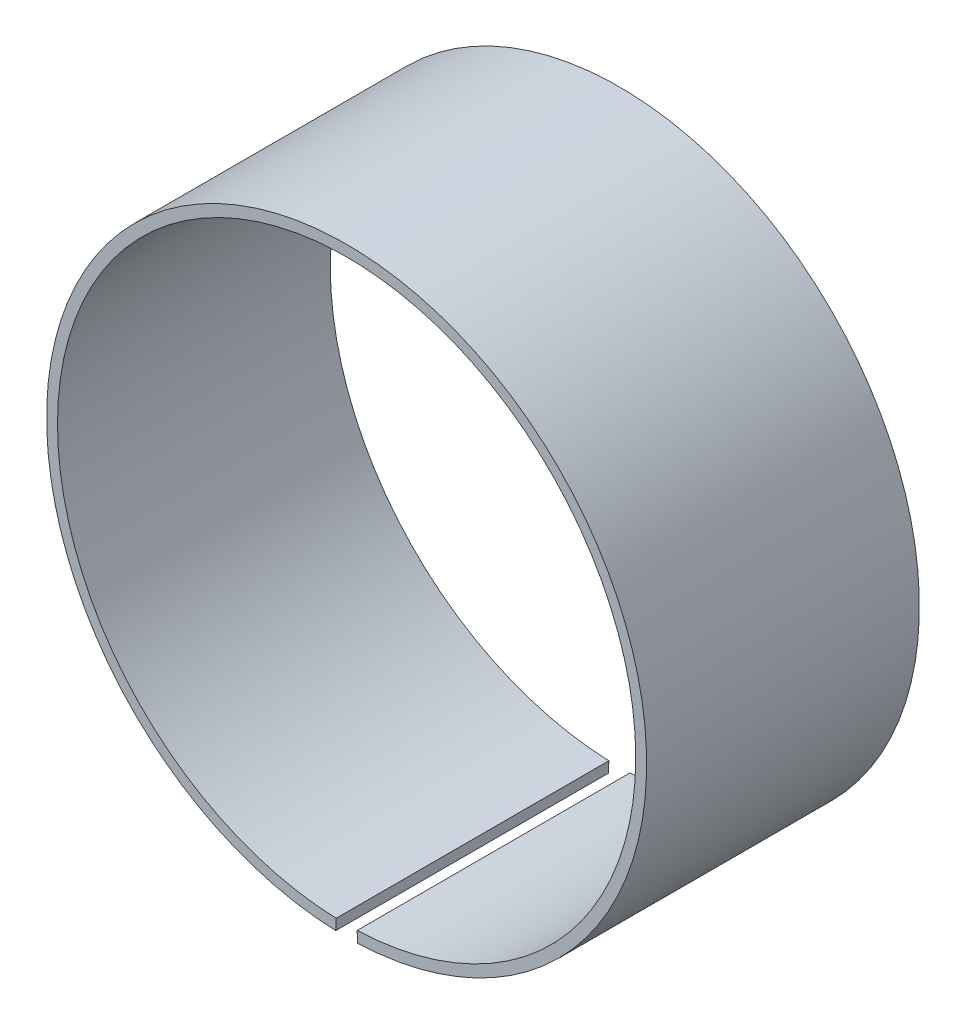
ISO-10303-21;
HEADER;
FILE_DESCRIPTION(('STEP AP214'),'2;1');
FILE_NAME('part.step','',(''),(''),'','','');
FILE_SCHEMA(('AUTOMOTIVE_DESIGN { 1 0 10303 214 1 1 1 1 }'));
ENDSEC;
DATA;
#1=APPLICATION_CONTEXT('core data for automotive mechanical design processes');
#2=APPLICATION_PROTOCOL_DEFINITION('international standard','automotive_design',2000,#1);
#3=PRODUCT_CONTEXT('',#1,'mechanical');
#4=PRODUCT('Part','Part','',(#3));
#5=PRODUCT_RELATED_PRODUCT_CATEGORY('part','',(#4));
#6=PRODUCT_DEFINITION_FORMATION('','',#4);
#7=PRODUCT_DEFINITION_CONTEXT('part definition',#1,'design');
#8=PRODUCT_DEFINITION('design','',#6,#7);
#9=PRODUCT_DEFINITION_SHAPE('','',#8);
#10=(LENGTH_UNIT() NAMED_UNIT(*) SI_UNIT(.MILLI.,.METRE.));
#11=(NAMED_UNIT(*) PLANE_ANGLE_UNIT() SI_UNIT($,.RADIAN.));
#12=(NAMED_UNIT(*) SI_UNIT($,.STERADIAN.) SOLID_ANGLE_UNIT());
#13=UNCERTAINTY_MEASURE_WITH_UNIT(LENGTH_MEASURE(1.E-05),#10,'distance_accuracy_value','');
#14=(GEOMETRIC_REPRESENTATION_CONTEXT(3) GLOBAL_UNCERTAINTY_ASSIGNED_CONTEXT((#13)) GLOBAL_UNIT_ASSIGNED_CONTEXT((#10,
#11,#12)) REPRESENTATION_CONTEXT('',''));
#15=CARTESIAN_POINT('',(0.,0.,0.));
#16=DIRECTION('',(0.,0.,1.));
#17=DIRECTION('',(1.,0.,0.));
#18=AXIS2_PLACEMENT_3D('',#15,#16,#17);
#19=CARTESIAN_POINT('',(0.,0.,2.5));
#20=DIRECTION('',(0.,0.,-1.));
#21=DIRECTION('',(-1.,0.,0.));
#22=AXIS2_PLACEMENT_3D('',#19,#20,#21);
#23=CYLINDRICAL_SURFACE('',#22,5.3);
#24=CARTESIAN_POINT('',(0.,0.,-2.5));
#25=DIRECTION('',(0.,0.,1.));
#26=DIRECTION('',(1.,0.,0.));
#27=AXIS2_PLACEMENT_3D('',#24,#25,#26);
#28=CIRCLE('',#27,5.3);
#29=CARTESIAN_POINT('',(-0.192727272727274,-5.29649470861126,-2.5));
#30=VERTEX_POINT('',#29);
#31=CARTESIAN_POINT('',(0.192727272727277,-5.29649470861126,-2.5));
#32=VERTEX_POINT('',#31);
#33=EDGE_CURVE('E100',#30,#32,#28,.F.);
#34=ORIENTED_EDGE('',*,*,#33,.T.);
#35=DIRECTION('',(0.,0.,-1.));
#36=VECTOR('',#35,1.);
#37=CARTESIAN_POINT('',(0.192727272727277,-5.29649470861126,2.5));
#38=LINE('',#37,#36);
#39=CARTESIAN_POINT('',(0.192727272727277,-5.29649470861126,2.5));
#40=VERTEX_POINT('',#39);
#41=EDGE_CURVE('E11',#40,#32,#38,.T.);
#42=ORIENTED_EDGE('',*,*,#41,.F.);
#43=CARTESIAN_POINT('',(0.,0.,2.5));
#44=DIRECTION('',(0.,0.,1.));
#45=DIRECTION('',(1.,0.,0.));
#46=AXIS2_PLACEMENT_3D('',#43,#44,#45);
#47=CIRCLE('',#46,5.3);
#48=CARTESIAN_POINT('',(-0.192727272727274,-5.29649470861126,2.5));
#49=VERTEX_POINT('',#48);
#50=EDGE_CURVE('E77',#49,#40,#47,.F.);
#51=ORIENTED_EDGE('',*,*,#50,.F.);
#52=DIRECTION('',(0.,0.,-1.));
#53=VECTOR('',#52,1.);
#54=CARTESIAN_POINT('',(-0.192727272727274,-5.29649470861126,2.5));
#55=LINE('',#54,#53);
#56=EDGE_CURVE('E53',#49,#30,#55,.T.);
#57=ORIENTED_EDGE('',*,*,#56,.T.);
#58=EDGE_LOOP('',(#34,#42,#51,#57));
#59=FACE_BOUND('',#58,.T.);
#60=ADVANCED_FACE('F37',(#59),#23,.F.);
#61=CARTESIAN_POINT('',(0.200000000000006,-5.49636243346452,2.5));
#62=DIRECTION('',(-0.999338624266276,-0.0363636363636472,0.));
#63=DIRECTION('',(0.0363636363636472,-0.999338624266276,0.));
#64=AXIS2_PLACEMENT_3D('',#61,#62,#63);
#65=PLANE('',#64);
#66=DIRECTION('',(-0.0363636363636472,0.999338624266276,0.));
#67=VECTOR('',#66,1.);
#68=CARTESIAN_POINT('',(0.200000000000006,-5.49636243346452,-2.5));
#69=LINE('',#68,#67);
#70=CARTESIAN_POINT('',(0.200000000000006,-5.49636243346452,-2.5));
#71=VERTEX_POINT('',#70);
#72=EDGE_CURVE('E86',#71,#32,#69,.T.);
#73=ORIENTED_EDGE('',*,*,#72,.F.);
#74=DIRECTION('',(0.,0.,-1.));
#75=VECTOR('',#74,1.);
#76=CARTESIAN_POINT('',(0.200000000000006,-5.49636243346452,2.5));
#77=LINE('',#76,#75);
#78=CARTESIAN_POINT('',(0.200000000000006,-5.49636243346452,2.5));
#79=VERTEX_POINT('',#78);
#80=EDGE_CURVE('E45',#79,#71,#77,.T.);
#81=ORIENTED_EDGE('',*,*,#80,.F.);
#82=DIRECTION('',(-0.0363636363636472,0.999338624266276,0.));
#83=VECTOR('',#82,1.);
#84=CARTESIAN_POINT('',(0.200000000000006,-5.49636243346452,2.5));
#85=LINE('',#84,#83);
#86=EDGE_CURVE('E84',#79,#40,#85,.T.);
#87=ORIENTED_EDGE('',*,*,#86,.T.);
#88=ORIENTED_EDGE('',*,*,#41,.T.);
#89=EDGE_LOOP('',(#73,#81,#87,#88));
#90=FACE_BOUND('',#89,.T.);
#91=ADVANCED_FACE('F83',(#90),#65,.T.);
#92=CARTESIAN_POINT('',(0.,0.,2.5));
#93=DIRECTION('',(0.,0.,-1.));
#94=DIRECTION('',(-1.,0.,0.));
#95=AXIS2_PLACEMENT_3D('',#92,#93,#94);
#96=CYLINDRICAL_SURFACE('',#95,5.5);
#97=CARTESIAN_POINT('',(0.,0.,-2.5));
#98=DIRECTION('',(0.,0.,-1.));
#99=DIRECTION('',(-1.,0.,0.));
#100=AXIS2_PLACEMENT_3D('',#97,#98,#99);
#101=CIRCLE('',#100,5.5);
#102=CARTESIAN_POINT('',(-0.199999999999999,-5.49636243346452,-2.5));
#103=VERTEX_POINT('',#102);
#104=EDGE_CURVE('E103',#103,#71,#101,.T.);
#105=ORIENTED_EDGE('',*,*,#104,.F.);
#106=DIRECTION('',(0.,0.,-1.));
#107=VECTOR('',#106,1.);
#108=CARTESIAN_POINT('',(-0.199999999999999,-5.49636243346452,2.5));
#109=LINE('',#108,#107);
#110=CARTESIAN_POINT('',(-0.199999999999999,-5.49636243346452,2.5));
#111=VERTEX_POINT('',#110);
#112=EDGE_CURVE('E66',#111,#103,#109,.T.);
#113=ORIENTED_EDGE('',*,*,#112,.F.);
#114=CARTESIAN_POINT('',(0.,0.,2.5));
#115=DIRECTION('',(0.,0.,-1.));
#116=DIRECTION('',(-1.,0.,0.));
#117=AXIS2_PLACEMENT_3D('',#114,#115,#116);
#118=CIRCLE('',#117,5.5);
#119=EDGE_CURVE('E92',#111,#79,#118,.T.);
#120=ORIENTED_EDGE('',*,*,#119,.T.);
#121=ORIENTED_EDGE('',*,*,#80,.T.);
#122=EDGE_LOOP('',(#105,#113,#120,#121));
#123=FACE_BOUND('',#122,.T.);
#124=ADVANCED_FACE('F94',(#123),#96,.T.);
#125=CARTESIAN_POINT('',(-0.192727272727274,-5.29649470861126,2.5));
#126=DIRECTION('',(0.999338624266277,-0.0363636363636268,0.));
#127=DIRECTION('',(0.0363636363636268,0.999338624266277,0.));
#128=AXIS2_PLACEMENT_3D('',#125,#126,#127);
#129=PLANE('',#128);
#130=DIRECTION('',(-0.0363636363636268,-0.999338624266276,0.));
#131=VECTOR('',#130,1.);
#132=CARTESIAN_POINT('',(-0.192727272727274,-5.29649470861126,-2.5));
#133=LINE('',#132,#131);
#134=EDGE_CURVE('E105',#30,#103,#133,.T.);
#135=ORIENTED_EDGE('',*,*,#134,.F.);
#136=ORIENTED_EDGE('',*,*,#56,.F.);
#137=DIRECTION('',(-0.0363636363636268,-0.999338624266276,0.));
#138=VECTOR('',#137,1.);
#139=CARTESIAN_POINT('',(-0.192727272727274,-5.29649470861126,2.5));
#140=LINE('',#139,#138);
#141=EDGE_CURVE('E95',#49,#111,#140,.T.);
#142=ORIENTED_EDGE('',*,*,#141,.T.);
#143=ORIENTED_EDGE('',*,*,#112,.T.);
#144=EDGE_LOOP('',(#135,#136,#142,#143));
#145=FACE_BOUND('',#144,.T.);
#146=ADVANCED_FACE('F111',(#145),#129,.T.);
#147=CARTESIAN_POINT('',(0.,0.,2.5));
#148=DIRECTION('',(0.,0.,1.));
#149=DIRECTION('',(1.,0.,0.));
#150=AXIS2_PLACEMENT_3D('',#147,#148,#149);
#151=PLANE('',#150);
#152=ORIENTED_EDGE('',*,*,#50,.T.);
#153=ORIENTED_EDGE('',*,*,#86,.F.);
#154=ORIENTED_EDGE('',*,*,#119,.F.);
#155=ORIENTED_EDGE('',*,*,#141,.F.);
#156=EDGE_LOOP('',(#152,#153,#154,#155));
#157=FACE_BOUND('',#156,.T.);
#158=ADVANCED_FACE('F91',(#157),#151,.T.);
#159=CARTESIAN_POINT('',(0.,0.,-2.5));
#160=DIRECTION('',(0.,0.,1.));
#161=DIRECTION('',(1.,0.,0.));
#162=AXIS2_PLACEMENT_3D('',#159,#160,#161);
#163=PLANE('',#162);
#164=ORIENTED_EDGE('',*,*,#33,.F.);
#165=ORIENTED_EDGE('',*,*,#134,.T.);
#166=ORIENTED_EDGE('',*,*,#104,.T.);
#167=ORIENTED_EDGE('',*,*,#72,.T.);
#168=EDGE_LOOP('',(#164,#165,#166,#167));
#169=FACE_BOUND('',#168,.T.);
#170=ADVANCED_FACE('F110',(#169),#163,.F.);
#171=CLOSED_SHELL('',(#60,#91,#124,#146,#158,#170));
#172=MANIFOLD_SOLID_BREP('B2',#171);
#173=ADVANCED_BREP_SHAPE_REPRESENTATION('',(#18,#172),#14);
#174=SHAPE_DEFINITION_REPRESENTATION(#9,#173);
ENDSEC;
END-ISO-10303-21;
